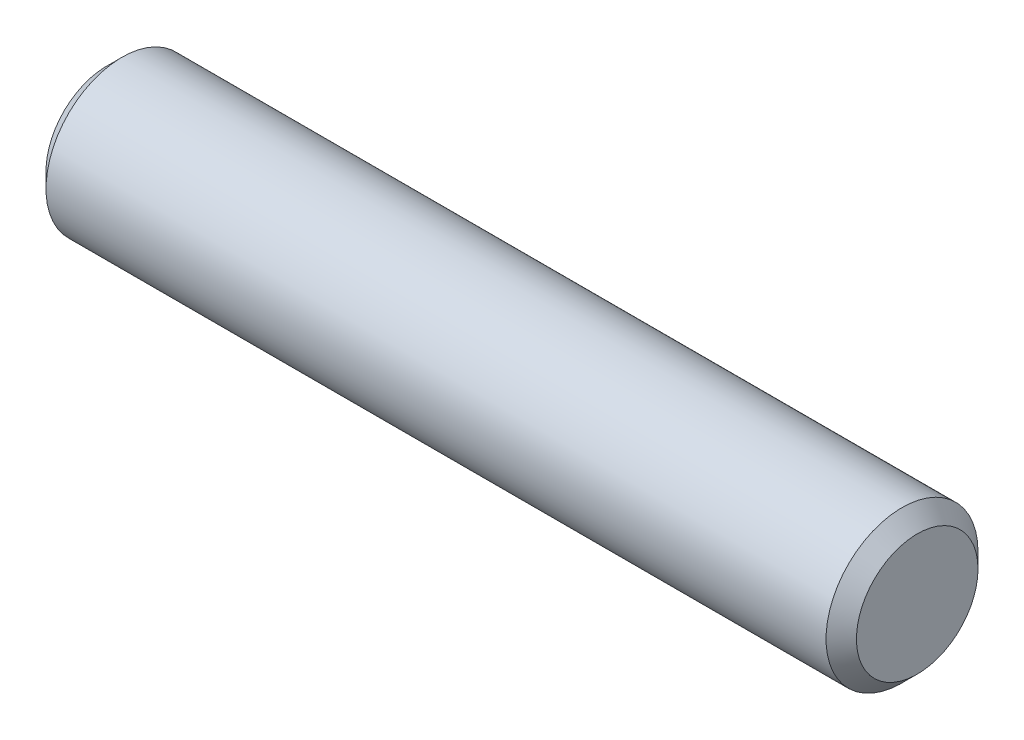
ISO-10303-21;
HEADER;
FILE_DESCRIPTION(('STEP AP214'),'2;1');
FILE_NAME('part.step','',(''),(''),'','','');
FILE_SCHEMA(('AUTOMOTIVE_DESIGN { 1 0 10303 214 1 1 1 1 }'));
ENDSEC;
DATA;
#1=APPLICATION_CONTEXT('core data for automotive mechanical design processes');
#2=APPLICATION_PROTOCOL_DEFINITION('international standard','automotive_design',2000,#1);
#3=PRODUCT_CONTEXT('',#1,'mechanical');
#4=PRODUCT('Part','Part','',(#3));
#5=PRODUCT_RELATED_PRODUCT_CATEGORY('part','',(#4));
#6=PRODUCT_DEFINITION_FORMATION('','',#4);
#7=PRODUCT_DEFINITION_CONTEXT('part definition',#1,'design');
#8=PRODUCT_DEFINITION('design','',#6,#7);
#9=PRODUCT_DEFINITION_SHAPE('','',#8);
#10=(LENGTH_UNIT() NAMED_UNIT(*) SI_UNIT(.MILLI.,.METRE.));
#11=(NAMED_UNIT(*) PLANE_ANGLE_UNIT() SI_UNIT($,.RADIAN.));
#12=(NAMED_UNIT(*) SI_UNIT($,.STERADIAN.) SOLID_ANGLE_UNIT());
#13=UNCERTAINTY_MEASURE_WITH_UNIT(LENGTH_MEASURE(1.E-05),#10,'distance_accuracy_value','');
#14=(GEOMETRIC_REPRESENTATION_CONTEXT(3) GLOBAL_UNCERTAINTY_ASSIGNED_CONTEXT((#13)) GLOBAL_UNIT_ASSIGNED_CONTEXT((#10,
#11,#12)) REPRESENTATION_CONTEXT('',''));
#15=CARTESIAN_POINT('',(0.,0.,0.));
#16=DIRECTION('',(0.,0.,1.));
#17=DIRECTION('',(1.,0.,0.));
#18=AXIS2_PLACEMENT_3D('',#15,#16,#17);
#19=CARTESIAN_POINT('',(-6.35,0.,0.));
#20=DIRECTION('',(1.,0.,0.));
#21=DIRECTION('',(0.,0.,-1.));
#22=AXIS2_PLACEMENT_3D('',#19,#20,#21);
#23=CYLINDRICAL_SURFACE('',#22,1.190625);
#24=CARTESIAN_POINT('',(6.111875,0.,0.));
#25=DIRECTION('',(1.,0.,0.));
#26=DIRECTION('',(0.,0.,-1.));
#27=AXIS2_PLACEMENT_3D('',#24,#25,#26);
#28=CIRCLE('',#27,1.190625);
#29=CARTESIAN_POINT('',(6.111875,0.,-1.190625));
#30=VERTEX_POINT('',#29);
#31=EDGE_CURVE('E42',#30,#30,#28,.F.);
#32=ORIENTED_EDGE('',*,*,#31,.T.);
#33=EDGE_LOOP('',(#32));
#34=FACE_BOUND('',#33,.T.);
#35=CARTESIAN_POINT('',(-6.111875,0.,0.));
#36=DIRECTION('',(1.,0.,0.));
#37=DIRECTION('',(0.,0.,-1.));
#38=AXIS2_PLACEMENT_3D('',#35,#36,#37);
#39=CIRCLE('',#38,1.190625);
#40=CARTESIAN_POINT('',(-6.111875,0.,-1.190625));
#41=VERTEX_POINT('',#40);
#42=EDGE_CURVE('E48',#41,#41,#39,.T.);
#43=ORIENTED_EDGE('',*,*,#42,.T.);
#44=EDGE_LOOP('',(#43));
#45=FACE_BOUND('',#44,.T.);
#46=ADVANCED_FACE('F34',(#34,#45),#23,.T.);
#47=CARTESIAN_POINT('',(-6.35,0.,0.));
#48=DIRECTION('',(1.,0.,0.));
#49=DIRECTION('',(0.,0.,-1.));
#50=AXIS2_PLACEMENT_3D('',#47,#48,#49);
#51=PLANE('',#50);
#52=CARTESIAN_POINT('',(-6.35,0.,0.));
#53=DIRECTION('',(1.,0.,0.));
#54=DIRECTION('',(0.,0.,-1.));
#55=AXIS2_PLACEMENT_3D('',#52,#53,#54);
#56=CIRCLE('',#55,0.9525);
#57=CARTESIAN_POINT('',(-6.35,0.,-0.9525));
#58=VERTEX_POINT('',#57);
#59=EDGE_CURVE('E10',#58,#58,#56,.F.);
#60=ORIENTED_EDGE('',*,*,#59,.T.);
#61=EDGE_LOOP('',(#60));
#62=FACE_BOUND('',#61,.T.);
#63=ADVANCED_FACE('F69',(#62),#51,.F.);
#64=CARTESIAN_POINT('',(6.35,0.,0.));
#65=DIRECTION('',(1.,0.,0.));
#66=DIRECTION('',(0.,0.,-1.));
#67=AXIS2_PLACEMENT_3D('',#64,#65,#66);
#68=PLANE('',#67);
#69=CARTESIAN_POINT('',(6.35,0.,0.));
#70=DIRECTION('',(1.,0.,0.));
#71=DIRECTION('',(0.,0.,-1.));
#72=AXIS2_PLACEMENT_3D('',#69,#70,#71);
#73=CIRCLE('',#72,0.9525);
#74=CARTESIAN_POINT('',(6.35,0.,-0.9525));
#75=VERTEX_POINT('',#74);
#76=EDGE_CURVE('E53',#75,#75,#73,.T.);
#77=ORIENTED_EDGE('',*,*,#76,.T.);
#78=EDGE_LOOP('',(#77));
#79=FACE_BOUND('',#78,.T.);
#80=ADVANCED_FACE('F59',(#79),#68,.T.);
#81=CARTESIAN_POINT('',(6.35,0.,0.));
#82=DIRECTION('',(-1.,0.,0.));
#83=DIRECTION('',(0.,0.,1.));
#84=AXIS2_PLACEMENT_3D('',#81,#82,#83);
#85=CONICAL_SURFACE('',#84,0.9525,0.785398163397447);
#86=ORIENTED_EDGE('',*,*,#31,.F.);
#87=EDGE_LOOP('',(#86));
#88=FACE_BOUND('',#87,.T.);
#89=ORIENTED_EDGE('',*,*,#76,.F.);
#90=EDGE_LOOP('',(#89));
#91=FACE_BOUND('',#90,.T.);
#92=ADVANCED_FACE('F61',(#88,#91),#85,.T.);
#93=CARTESIAN_POINT('',(-6.111875,0.,0.));
#94=DIRECTION('',(1.,0.,0.));
#95=DIRECTION('',(0.,0.,-1.));
#96=AXIS2_PLACEMENT_3D('',#93,#94,#95);
#97=CONICAL_SURFACE('',#96,1.190625,0.785398163397451);
#98=ORIENTED_EDGE('',*,*,#59,.F.);
#99=EDGE_LOOP('',(#98));
#100=FACE_BOUND('',#99,.T.);
#101=ORIENTED_EDGE('',*,*,#42,.F.);
#102=EDGE_LOOP('',(#101));
#103=FACE_BOUND('',#102,.T.);
#104=ADVANCED_FACE('F36',(#100,#103),#97,.T.);
#105=CLOSED_SHELL('',(#46,#63,#80,#92,#104));
#106=MANIFOLD_SOLID_BREP('B2',#105);
#107=ADVANCED_BREP_SHAPE_REPRESENTATION('',(#18,#106),#14);
#108=SHAPE_DEFINITION_REPRESENTATION(#9,#107);
ENDSEC;
END-ISO-10303-21;
